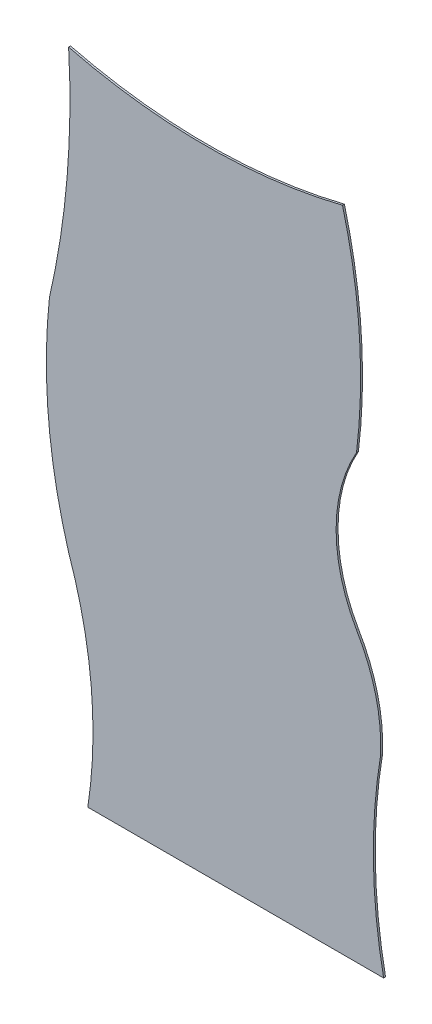
ISO-10303-21;
HEADER;
FILE_DESCRIPTION(('STEP AP214'),'2;1');
FILE_NAME('part.step','',(''),(''),'','','');
FILE_SCHEMA(('AUTOMOTIVE_DESIGN { 1 0 10303 214 1 1 1 1 }'));
ENDSEC;
DATA;
#1=APPLICATION_CONTEXT('core data for automotive mechanical design processes');
#2=APPLICATION_PROTOCOL_DEFINITION('international standard','automotive_design',2000,#1);
#3=PRODUCT_CONTEXT('',#1,'mechanical');
#4=PRODUCT('Part','Part','',(#3));
#5=PRODUCT_RELATED_PRODUCT_CATEGORY('part','',(#4));
#6=PRODUCT_DEFINITION_FORMATION('','',#4);
#7=PRODUCT_DEFINITION_CONTEXT('part definition',#1,'design');
#8=PRODUCT_DEFINITION('design','',#6,#7);
#9=PRODUCT_DEFINITION_SHAPE('','',#8);
#10=(LENGTH_UNIT() NAMED_UNIT(*) SI_UNIT(.MILLI.,.METRE.));
#11=(NAMED_UNIT(*) PLANE_ANGLE_UNIT() SI_UNIT($,.RADIAN.));
#12=(NAMED_UNIT(*) SI_UNIT($,.STERADIAN.) SOLID_ANGLE_UNIT());
#13=UNCERTAINTY_MEASURE_WITH_UNIT(LENGTH_MEASURE(1.E-05),#10,'distance_accuracy_value','');
#14=(GEOMETRIC_REPRESENTATION_CONTEXT(3) GLOBAL_UNCERTAINTY_ASSIGNED_CONTEXT((#13)) GLOBAL_UNIT_ASSIGNED_CONTEXT((#10,
#11,#12)) REPRESENTATION_CONTEXT('',''));
#15=CARTESIAN_POINT('',(0.,0.,0.));
#16=DIRECTION('',(0.,0.,1.));
#17=DIRECTION('',(1.,0.,0.));
#18=AXIS2_PLACEMENT_3D('',#15,#16,#17);
#19=CARTESIAN_POINT('',(-31.7197035305823,43.5000328470985,0.1));
#20=DIRECTION('',(0.,0.,-1.));
#21=DIRECTION('',(-1.,0.,0.));
#22=AXIS2_PLACEMENT_3D('',#19,#20,#21);
#23=CYLINDRICAL_SURFACE('',#22,41.8686804553423);
#24=CARTESIAN_POINT('',(-31.7197035305823,43.5000328470985,0.));
#25=DIRECTION('',(0.,0.,-1.));
#26=DIRECTION('',(1.,0.,0.));
#27=AXIS2_PLACEMENT_3D('',#24,#25,#26);
#28=CIRCLE('',#27,41.8686804553423);
#29=CARTESIAN_POINT('',(10.080135102766,45.9000106173295,0.));
#30=VERTEX_POINT('',#29);
#31=CARTESIAN_POINT('',(9.08013003751042,34.1000337041466,0.));
#32=VERTEX_POINT('',#31);
#33=EDGE_CURVE('E135',#30,#32,#28,.T.);
#34=ORIENTED_EDGE('',*,*,#33,.T.);
#35=DIRECTION('',(0.,0.,-1.));
#36=VECTOR('',#35,1.);
#37=CARTESIAN_POINT('',(9.08013003751042,34.1000337041466,0.1));
#38=LINE('',#37,#36);
#39=CARTESIAN_POINT('',(9.08013003751042,34.1000337041466,0.1));
#40=VERTEX_POINT('',#39);
#41=EDGE_CURVE('E11',#40,#32,#38,.T.);
#42=ORIENTED_EDGE('',*,*,#41,.F.);
#43=CARTESIAN_POINT('',(-31.7197035305823,43.5000328470985,0.1));
#44=DIRECTION('',(0.,0.,-1.));
#45=DIRECTION('',(1.,0.,0.));
#46=AXIS2_PLACEMENT_3D('',#43,#44,#45);
#47=CIRCLE('',#46,41.8686804553423);
#48=CARTESIAN_POINT('',(10.080135102766,45.9000106173295,0.1));
#49=VERTEX_POINT('',#48);
#50=EDGE_CURVE('E151',#49,#40,#47,.T.);
#51=ORIENTED_EDGE('',*,*,#50,.F.);
#52=DIRECTION('',(0.,0.,-1.));
#53=VECTOR('',#52,1.);
#54=CARTESIAN_POINT('',(10.080135102766,45.9000106173295,0.1));
#55=LINE('',#54,#53);
#56=EDGE_CURVE('E131',#49,#30,#55,.T.);
#57=ORIENTED_EDGE('',*,*,#56,.T.);
#58=EDGE_LOOP('',(#34,#42,#51,#57));
#59=FACE_BOUND('',#58,.T.);
#60=ADVANCED_FACE('F33',(#59),#23,.F.);
#61=CARTESIAN_POINT('',(37.0801284059803,31.1000184765895,0.1));
#62=DIRECTION('',(0.,0.,-1.));
#63=DIRECTION('',(-1.,0.,0.));
#64=AXIS2_PLACEMENT_3D('',#61,#62,#63);
#65=CYLINDRICAL_SURFACE('',#64,28.1602556806555);
#66=CARTESIAN_POINT('',(37.0801284059803,31.1000184765895,0.));
#67=DIRECTION('',(0.,0.,1.));
#68=DIRECTION('',(1.,0.,0.));
#69=AXIS2_PLACEMENT_3D('',#66,#67,#68);
#70=CIRCLE('',#69,28.1602556806555);
#71=CARTESIAN_POINT('',(10.0801240552555,23.1000331603073,0.));
#72=VERTEX_POINT('',#71);
#73=EDGE_CURVE('E138',#32,#72,#70,.T.);
#74=ORIENTED_EDGE('',*,*,#73,.T.);
#75=DIRECTION('',(0.,0.,-1.));
#76=VECTOR('',#75,1.);
#77=CARTESIAN_POINT('',(10.0801240552555,23.1000331603073,0.1));
#78=LINE('',#77,#76);
#79=CARTESIAN_POINT('',(10.0801240552555,23.1000331603073,0.1));
#80=VERTEX_POINT('',#79);
#81=EDGE_CURVE('E41',#80,#72,#78,.T.);
#82=ORIENTED_EDGE('',*,*,#81,.F.);
#83=CARTESIAN_POINT('',(37.0801284059803,31.1000184765895,0.1));
#84=DIRECTION('',(0.,0.,1.));
#85=DIRECTION('',(1.,0.,0.));
#86=AXIS2_PLACEMENT_3D('',#83,#84,#85);
#87=CIRCLE('',#86,28.1602556806555);
#88=EDGE_CURVE('E95',#40,#80,#87,.T.);
#89=ORIENTED_EDGE('',*,*,#88,.F.);
#90=ORIENTED_EDGE('',*,*,#41,.T.);
#91=EDGE_LOOP('',(#74,#82,#89,#90));
#92=FACE_BOUND('',#91,.T.);
#93=ADVANCED_FACE('F194',(#92),#65,.T.);
#94=CARTESIAN_POINT('',(-11.4198800235507,15.6000448528974,0.1));
#95=DIRECTION('',(0.,0.,-1.));
#96=DIRECTION('',(-1.,0.,0.));
#97=AXIS2_PLACEMENT_3D('',#94,#95,#96);
#98=CYLINDRICAL_SURFACE('',#97,22.7705950734707);
#99=CARTESIAN_POINT('',(-11.4198800235507,15.6000448528974,0.));
#100=DIRECTION('',(0.,0.,-1.));
#101=DIRECTION('',(1.,0.,0.));
#102=AXIS2_PLACEMENT_3D('',#99,#100,#101);
#103=CIRCLE('',#102,22.7705950734707);
#104=CARTESIAN_POINT('',(11.0801180730005,12.1000326164675,0.));
#105=VERTEX_POINT('',#104);
#106=EDGE_CURVE('E140',#72,#105,#103,.T.);
#107=ORIENTED_EDGE('',*,*,#106,.T.);
#108=DIRECTION('',(0.,0.,-1.));
#109=VECTOR('',#108,1.);
#110=CARTESIAN_POINT('',(11.0801180730005,12.1000326164675,0.1));
#111=LINE('',#110,#109);
#112=CARTESIAN_POINT('',(11.0801180730005,12.1000326164675,0.1));
#113=VERTEX_POINT('',#112);
#114=EDGE_CURVE('E161',#113,#105,#111,.T.);
#115=ORIENTED_EDGE('',*,*,#114,.F.);
#116=CARTESIAN_POINT('',(-11.4198800235507,15.6000448528974,0.1));
#117=DIRECTION('',(0.,0.,-1.));
#118=DIRECTION('',(1.,0.,0.));
#119=AXIS2_PLACEMENT_3D('',#116,#117,#118);
#120=CIRCLE('',#119,22.7705950734707);
#121=EDGE_CURVE('E169',#80,#113,#120,.T.);
#122=ORIENTED_EDGE('',*,*,#121,.F.);
#123=ORIENTED_EDGE('',*,*,#81,.T.);
#124=EDGE_LOOP('',(#107,#115,#122,#123));
#125=FACE_BOUND('',#124,.T.);
#126=ADVANCED_FACE('F167',(#125),#98,.F.);
#127=CARTESIAN_POINT('',(11.0801180730005,12.1000326164675,0.1));
#128=DIRECTION('',(1.24450502068269E-06,0.999999999999226,0.));
#129=DIRECTION('',(-0.999999999999226,1.24450502068269E-06,0.));
#130=AXIS2_PLACEMENT_3D('',#127,#128,#129);
#131=PLANE('',#130);
#132=DIRECTION('',(0.999999999999226,-1.24450502068269E-06,0.));
#133=VECTOR('',#132,1.);
#134=CARTESIAN_POINT('',(11.0801180730005,12.1000326164675,0.));
#135=LINE('',#134,#133);
#136=CARTESIAN_POINT('',(26.4941722911851,12.1000134335997,0.));
#137=VERTEX_POINT('',#136);
#138=EDGE_CURVE('E142',#105,#137,#135,.T.);
#139=ORIENTED_EDGE('',*,*,#138,.T.);
#140=DIRECTION('',(0.,0.,-1.));
#141=VECTOR('',#140,1.);
#142=CARTESIAN_POINT('',(26.4941722911851,12.1000134335997,0.1));
#143=LINE('',#142,#141);
#144=CARTESIAN_POINT('',(26.4941722911851,12.1000134335997,0.1));
#145=VERTEX_POINT('',#144);
#146=EDGE_CURVE('E158',#145,#137,#143,.T.);
#147=ORIENTED_EDGE('',*,*,#146,.F.);
#148=DIRECTION('',(0.999999999999226,-1.24450502068269E-06,0.));
#149=VECTOR('',#148,1.);
#150=CARTESIAN_POINT('',(11.0801180730005,12.1000326164675,0.1));
#151=LINE('',#150,#149);
#152=EDGE_CURVE('E185',#113,#145,#151,.T.);
#153=ORIENTED_EDGE('',*,*,#152,.F.);
#154=ORIENTED_EDGE('',*,*,#114,.T.);
#155=EDGE_LOOP('',(#139,#147,#153,#154));
#156=FACE_BOUND('',#155,.T.);
#157=ADVANCED_FACE('F178',(#156),#131,.F.);
#158=CARTESIAN_POINT('',(53.5815490706422,17.5135915117737,0.1));
#159=DIRECTION('',(0.,0.,-1.));
#160=DIRECTION('',(-1.,0.,0.));
#161=AXIS2_PLACEMENT_3D('',#158,#159,#160);
#162=CYLINDRICAL_SURFACE('',#161,27.62304849941);
#163=CARTESIAN_POINT('',(53.5815490706422,17.5135915117737,0.));
#164=DIRECTION('',(0.,0.,-1.));
#165=DIRECTION('',(1.,0.,0.));
#166=AXIS2_PLACEMENT_3D('',#163,#164,#165);
#167=CIRCLE('',#166,27.62304849941);
#168=CARTESIAN_POINT('',(26.3348825764364,22.0580357411909,0.));
#169=VERTEX_POINT('',#168);
#170=EDGE_CURVE('E144',#137,#169,#167,.T.);
#171=ORIENTED_EDGE('',*,*,#170,.T.);
#172=DIRECTION('',(0.,0.,-1.));
#173=VECTOR('',#172,1.);
#174=CARTESIAN_POINT('',(26.3348825764364,22.0580357411909,0.1));
#175=LINE('',#174,#173);
#176=CARTESIAN_POINT('',(26.3348825764364,22.0580357411909,0.1));
#177=VERTEX_POINT('',#176);
#178=EDGE_CURVE('E155',#177,#169,#175,.T.);
#179=ORIENTED_EDGE('',*,*,#178,.F.);
#180=CARTESIAN_POINT('',(53.5815490706422,17.5135915117737,0.1));
#181=DIRECTION('',(0.,0.,-1.));
#182=DIRECTION('',(1.,0.,0.));
#183=AXIS2_PLACEMENT_3D('',#180,#181,#182);
#184=CIRCLE('',#183,27.62304849941);
#185=EDGE_CURVE('E184',#145,#177,#184,.T.);
#186=ORIENTED_EDGE('',*,*,#185,.F.);
#187=ORIENTED_EDGE('',*,*,#146,.T.);
#188=EDGE_LOOP('',(#171,#179,#186,#187));
#189=FACE_BOUND('',#188,.T.);
#190=ADVANCED_FACE('F182',(#189),#162,.F.);
#191=CARTESIAN_POINT('',(17.2985870414739,22.4863756925503,0.1));
#192=DIRECTION('',(0.,0.,-1.));
#193=DIRECTION('',(-1.,0.,0.));
#194=AXIS2_PLACEMENT_3D('',#191,#192,#193);
#195=CYLINDRICAL_SURFACE('',#194,9.04644195853345);
#196=CARTESIAN_POINT('',(17.2985870414739,22.4863756925503,0.));
#197=DIRECTION('',(0.,0.,1.));
#198=DIRECTION('',(1.,0.,0.));
#199=AXIS2_PLACEMENT_3D('',#196,#197,#198);
#200=CIRCLE('',#199,9.04644195853345);
#201=CARTESIAN_POINT('',(25.0801262306187,27.1000250026864,0.));
#202=VERTEX_POINT('',#201);
#203=EDGE_CURVE('E146',#169,#202,#200,.T.);
#204=ORIENTED_EDGE('',*,*,#203,.T.);
#205=DIRECTION('',(0.,0.,-1.));
#206=VECTOR('',#205,1.);
#207=CARTESIAN_POINT('',(25.0801262306187,27.1000250026864,0.1));
#208=LINE('',#207,#206);
#209=CARTESIAN_POINT('',(25.0801262306187,27.1000250026864,0.1));
#210=VERTEX_POINT('',#209);
#211=EDGE_CURVE('E126',#210,#202,#208,.T.);
#212=ORIENTED_EDGE('',*,*,#211,.F.);
#213=CARTESIAN_POINT('',(17.2985870414739,22.4863756925503,0.1));
#214=DIRECTION('',(0.,0.,1.));
#215=DIRECTION('',(1.,0.,0.));
#216=AXIS2_PLACEMENT_3D('',#213,#214,#215);
#217=CIRCLE('',#216,9.04644195853345);
#218=EDGE_CURVE('E117',#177,#210,#217,.T.);
#219=ORIENTED_EDGE('',*,*,#218,.F.);
#220=ORIENTED_EDGE('',*,*,#178,.T.);
#221=EDGE_LOOP('',(#204,#212,#219,#220));
#222=FACE_BOUND('',#221,.T.);
#223=ADVANCED_FACE('F206',(#222),#195,.T.);
#224=CARTESIAN_POINT('',(32.0801284059826,31.1000211957963,0.1));
#225=DIRECTION('',(0.,0.,-1.));
#226=DIRECTION('',(-1.,0.,0.));
#227=AXIS2_PLACEMENT_3D('',#224,#225,#226);
#228=CYLINDRICAL_SURFACE('',#227,8.06225774829819);
#229=CARTESIAN_POINT('',(32.0801284059826,31.1000211957963,0.));
#230=DIRECTION('',(0.,0.,-1.));
#231=DIRECTION('',(1.,0.,0.));
#232=AXIS2_PLACEMENT_3D('',#229,#230,#231);
#233=CIRCLE('',#232,8.06225774829819);
#234=CARTESIAN_POINT('',(25.0801305813495,35.1000250026852,0.));
#235=VERTEX_POINT('',#234);
#236=EDGE_CURVE('E125',#202,#235,#233,.T.);
#237=ORIENTED_EDGE('',*,*,#236,.T.);
#238=DIRECTION('',(0.,0.,-1.));
#239=VECTOR('',#238,1.);
#240=CARTESIAN_POINT('',(25.0801305813495,35.1000250026852,0.1));
#241=LINE('',#240,#239);
#242=CARTESIAN_POINT('',(25.0801305813495,35.1000250026852,0.1));
#243=VERTEX_POINT('',#242);
#244=EDGE_CURVE('E122',#243,#235,#241,.T.);
#245=ORIENTED_EDGE('',*,*,#244,.F.);
#246=CARTESIAN_POINT('',(32.0801284059826,31.1000211957963,0.1));
#247=DIRECTION('',(0.,0.,-1.));
#248=DIRECTION('',(1.,0.,0.));
#249=AXIS2_PLACEMENT_3D('',#246,#247,#248);
#250=CIRCLE('',#249,8.06225774829819);
#251=EDGE_CURVE('E111',#210,#243,#250,.T.);
#252=ORIENTED_EDGE('',*,*,#251,.F.);
#253=ORIENTED_EDGE('',*,*,#211,.T.);
#254=EDGE_LOOP('',(#237,#245,#252,#253));
#255=FACE_BOUND('',#254,.T.);
#256=ADVANCED_FACE('F123',(#255),#228,.F.);
#257=CARTESIAN_POINT('',(-3.41240796645028,38.6000404981064,0.1));
#258=DIRECTION('',(0.,0.,-1.));
#259=DIRECTION('',(-1.,0.,0.));
#260=AXIS2_PLACEMENT_3D('',#257,#258,#259);
#261=CYLINDRICAL_SURFACE('',#260,28.7067041188299);
#262=CARTESIAN_POINT('',(-3.41240796645028,38.6000404981064,0.));
#263=DIRECTION('',(0.,0.,1.));
#264=DIRECTION('',(1.,0.,0.));
#265=AXIS2_PLACEMENT_3D('',#262,#263,#264);
#266=CIRCLE('',#265,28.7067041188299);
#267=CARTESIAN_POINT('',(24.3506133811087,45.9000067323454,0.));
#268=VERTEX_POINT('',#267);
#269=EDGE_CURVE('E81',#235,#268,#266,.T.);
#270=ORIENTED_EDGE('',*,*,#269,.T.);
#271=DIRECTION('',(0.,0.,-1.));
#272=VECTOR('',#271,1.);
#273=CARTESIAN_POINT('',(24.3506133811087,45.9000067323454,0.1));
#274=LINE('',#273,#272);
#275=CARTESIAN_POINT('',(24.3506133811087,45.9000067323454,0.1));
#276=VERTEX_POINT('',#275);
#277=EDGE_CURVE('E127',#276,#268,#274,.T.);
#278=ORIENTED_EDGE('',*,*,#277,.F.);
#279=CARTESIAN_POINT('',(-3.41240796645028,38.6000404981064,0.1));
#280=DIRECTION('',(0.,0.,1.));
#281=DIRECTION('',(1.,0.,0.));
#282=AXIS2_PLACEMENT_3D('',#279,#280,#281);
#283=CIRCLE('',#282,28.7067041188299);
#284=EDGE_CURVE('E115',#243,#276,#283,.T.);
#285=ORIENTED_EDGE('',*,*,#284,.F.);
#286=ORIENTED_EDGE('',*,*,#244,.T.);
#287=EDGE_LOOP('',(#270,#278,#285,#286));
#288=FACE_BOUND('',#287,.T.);
#289=ADVANCED_FACE('F129',(#288),#261,.T.);
#290=CARTESIAN_POINT('',(17.2153820200913,74.4710341033217,0.1));
#291=DIRECTION('',(0.,0.,-1.));
#292=DIRECTION('',(-1.,0.,0.));
#293=AXIS2_PLACEMENT_3D('',#290,#291,#292);
#294=CYLINDRICAL_SURFACE('',#293,29.448516628318);
#295=CARTESIAN_POINT('',(17.2153820200913,74.4710341033217,0.));
#296=DIRECTION('',(0.,0.,-1.));
#297=DIRECTION('',(1.,0.,0.));
#298=AXIS2_PLACEMENT_3D('',#295,#296,#297);
#299=CIRCLE('',#298,29.448516628318);
#300=EDGE_CURVE('E87',#268,#30,#299,.T.);
#301=ORIENTED_EDGE('',*,*,#300,.T.);
#302=ORIENTED_EDGE('',*,*,#56,.F.);
#303=CARTESIAN_POINT('',(17.2153820200913,74.4710341033217,0.1));
#304=DIRECTION('',(0.,0.,-1.));
#305=DIRECTION('',(1.,0.,0.));
#306=AXIS2_PLACEMENT_3D('',#303,#304,#305);
#307=CIRCLE('',#306,29.448516628318);
#308=EDGE_CURVE('E49',#276,#49,#307,.T.);
#309=ORIENTED_EDGE('',*,*,#308,.F.);
#310=ORIENTED_EDGE('',*,*,#277,.T.);
#311=EDGE_LOOP('',(#301,#302,#309,#310));
#312=FACE_BOUND('',#311,.T.);
#313=ADVANCED_FACE('F214',(#312),#294,.F.);
#314=CARTESIAN_POINT('',(-31.7197035305823,43.5000328470985,0.1));
#315=DIRECTION('',(0.,0.,1.));
#316=DIRECTION('',(1.,0.,0.));
#317=AXIS2_PLACEMENT_3D('',#314,#315,#316);
#318=PLANE('',#317);
#319=ORIENTED_EDGE('',*,*,#50,.T.);
#320=ORIENTED_EDGE('',*,*,#88,.T.);
#321=ORIENTED_EDGE('',*,*,#121,.T.);
#322=ORIENTED_EDGE('',*,*,#152,.T.);
#323=ORIENTED_EDGE('',*,*,#185,.T.);
#324=ORIENTED_EDGE('',*,*,#218,.T.);
#325=ORIENTED_EDGE('',*,*,#251,.T.);
#326=ORIENTED_EDGE('',*,*,#284,.T.);
#327=ORIENTED_EDGE('',*,*,#308,.T.);
#328=EDGE_LOOP('',(#319,#320,#321,#322,#323,#324,#325,#326,#327));
#329=FACE_BOUND('',#328,.T.);
#330=ADVANCED_FACE('F113',(#329),#318,.T.);
#331=CARTESIAN_POINT('',(-31.7197035305823,43.5000328470985,0.));
#332=DIRECTION('',(0.,0.,1.));
#333=DIRECTION('',(1.,0.,0.));
#334=AXIS2_PLACEMENT_3D('',#331,#332,#333);
#335=PLANE('',#334);
#336=ORIENTED_EDGE('',*,*,#33,.F.);
#337=ORIENTED_EDGE('',*,*,#300,.F.);
#338=ORIENTED_EDGE('',*,*,#269,.F.);
#339=ORIENTED_EDGE('',*,*,#236,.F.);
#340=ORIENTED_EDGE('',*,*,#203,.F.);
#341=ORIENTED_EDGE('',*,*,#170,.F.);
#342=ORIENTED_EDGE('',*,*,#138,.F.);
#343=ORIENTED_EDGE('',*,*,#106,.F.);
#344=ORIENTED_EDGE('',*,*,#73,.F.);
#345=EDGE_LOOP('',(#336,#337,#338,#339,#340,#341,#342,#343,#344));
#346=FACE_BOUND('',#345,.T.);
#347=ADVANCED_FACE('F173',(#346),#335,.F.);
#348=CLOSED_SHELL('',(#60,#93,#126,#157,#190,#223,#256,#289,#313,#330,#347));
#349=MANIFOLD_SOLID_BREP('B2',#348);
#350=ADVANCED_BREP_SHAPE_REPRESENTATION('',(#18,#349),#14);
#351=SHAPE_DEFINITION_REPRESENTATION(#9,#350);
ENDSEC;
END-ISO-10303-21;
